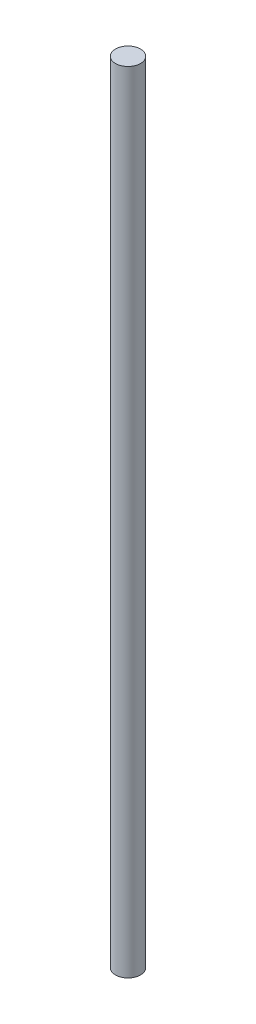
ISO-10303-21;
HEADER;
FILE_DESCRIPTION(('STEP AP214'),'2;1');
FILE_NAME('part.step','',(''),(''),'','','');
FILE_SCHEMA(('AUTOMOTIVE_DESIGN { 1 0 10303 214 1 1 1 1 }'));
ENDSEC;
DATA;
#1=APPLICATION_CONTEXT('core data for automotive mechanical design processes');
#2=APPLICATION_PROTOCOL_DEFINITION('international standard','automotive_design',2000,#1);
#3=PRODUCT_CONTEXT('',#1,'mechanical');
#4=PRODUCT('Part','Part','',(#3));
#5=PRODUCT_RELATED_PRODUCT_CATEGORY('part','',(#4));
#6=PRODUCT_DEFINITION_FORMATION('','',#4);
#7=PRODUCT_DEFINITION_CONTEXT('part definition',#1,'design');
#8=PRODUCT_DEFINITION('design','',#6,#7);
#9=PRODUCT_DEFINITION_SHAPE('','',#8);
#10=(LENGTH_UNIT() NAMED_UNIT(*) SI_UNIT(.MILLI.,.METRE.));
#11=(NAMED_UNIT(*) PLANE_ANGLE_UNIT() SI_UNIT($,.RADIAN.));
#12=(NAMED_UNIT(*) SI_UNIT($,.STERADIAN.) SOLID_ANGLE_UNIT());
#13=UNCERTAINTY_MEASURE_WITH_UNIT(LENGTH_MEASURE(1.E-05),#10,'distance_accuracy_value','');
#14=(GEOMETRIC_REPRESENTATION_CONTEXT(3) GLOBAL_UNCERTAINTY_ASSIGNED_CONTEXT((#13)) GLOBAL_UNIT_ASSIGNED_CONTEXT((#10,
#11,#12)) REPRESENTATION_CONTEXT('',''));
#15=CARTESIAN_POINT('',(0.,0.,0.));
#16=DIRECTION('',(0.,0.,1.));
#17=DIRECTION('',(1.,0.,0.));
#18=AXIS2_PLACEMENT_3D('',#15,#16,#17);
#19=CARTESIAN_POINT('',(0.,200.,0.));
#20=DIRECTION('',(0.,-1.,0.));
#21=DIRECTION('',(0.,0.,-1.));
#22=AXIS2_PLACEMENT_3D('',#19,#20,#21);
#23=CYLINDRICAL_SURFACE('',#22,3.175);
#24=CARTESIAN_POINT('',(0.,200.,0.));
#25=DIRECTION('',(0.,1.,0.));
#26=DIRECTION('',(0.,0.,1.));
#27=AXIS2_PLACEMENT_3D('',#24,#25,#26);
#28=CIRCLE('',#27,3.175);
#29=CARTESIAN_POINT('',(0.,200.,3.175));
#30=VERTEX_POINT('',#29);
#31=EDGE_CURVE('E10',#30,#30,#28,.T.);
#32=ORIENTED_EDGE('',*,*,#31,.F.);
#33=EDGE_LOOP('',(#32));
#34=FACE_BOUND('',#33,.T.);
#35=CARTESIAN_POINT('',(0.,0.,0.));
#36=DIRECTION('',(0.,1.,0.));
#37=DIRECTION('',(0.,0.,1.));
#38=AXIS2_PLACEMENT_3D('',#35,#36,#37);
#39=CIRCLE('',#38,3.175);
#40=CARTESIAN_POINT('',(0.,0.,3.175));
#41=VERTEX_POINT('',#40);
#42=EDGE_CURVE('E37',#41,#41,#39,.T.);
#43=ORIENTED_EDGE('',*,*,#42,.T.);
#44=EDGE_LOOP('',(#43));
#45=FACE_BOUND('',#44,.T.);
#46=ADVANCED_FACE('F40',(#34,#45),#23,.T.);
#47=CARTESIAN_POINT('',(0.,200.,0.));
#48=DIRECTION('',(0.,1.,0.));
#49=DIRECTION('',(0.,0.,1.));
#50=AXIS2_PLACEMENT_3D('',#47,#48,#49);
#51=PLANE('',#50);
#52=ORIENTED_EDGE('',*,*,#31,.T.);
#53=EDGE_LOOP('',(#52));
#54=FACE_BOUND('',#53,.T.);
#55=ADVANCED_FACE('F55',(#54),#51,.T.);
#56=CARTESIAN_POINT('',(0.,0.,0.));
#57=DIRECTION('',(0.,1.,0.));
#58=DIRECTION('',(0.,0.,1.));
#59=AXIS2_PLACEMENT_3D('',#56,#57,#58);
#60=PLANE('',#59);
#61=ORIENTED_EDGE('',*,*,#42,.F.);
#62=EDGE_LOOP('',(#61));
#63=FACE_BOUND('',#62,.T.);
#64=ADVANCED_FACE('F49',(#63),#60,.F.);
#65=CLOSED_SHELL('',(#46,#55,#64));
#66=MANIFOLD_SOLID_BREP('B2',#65);
#67=ADVANCED_BREP_SHAPE_REPRESENTATION('',(#18,#66),#14);
#68=SHAPE_DEFINITION_REPRESENTATION(#9,#67);
ENDSEC;
END-ISO-10303-21;
